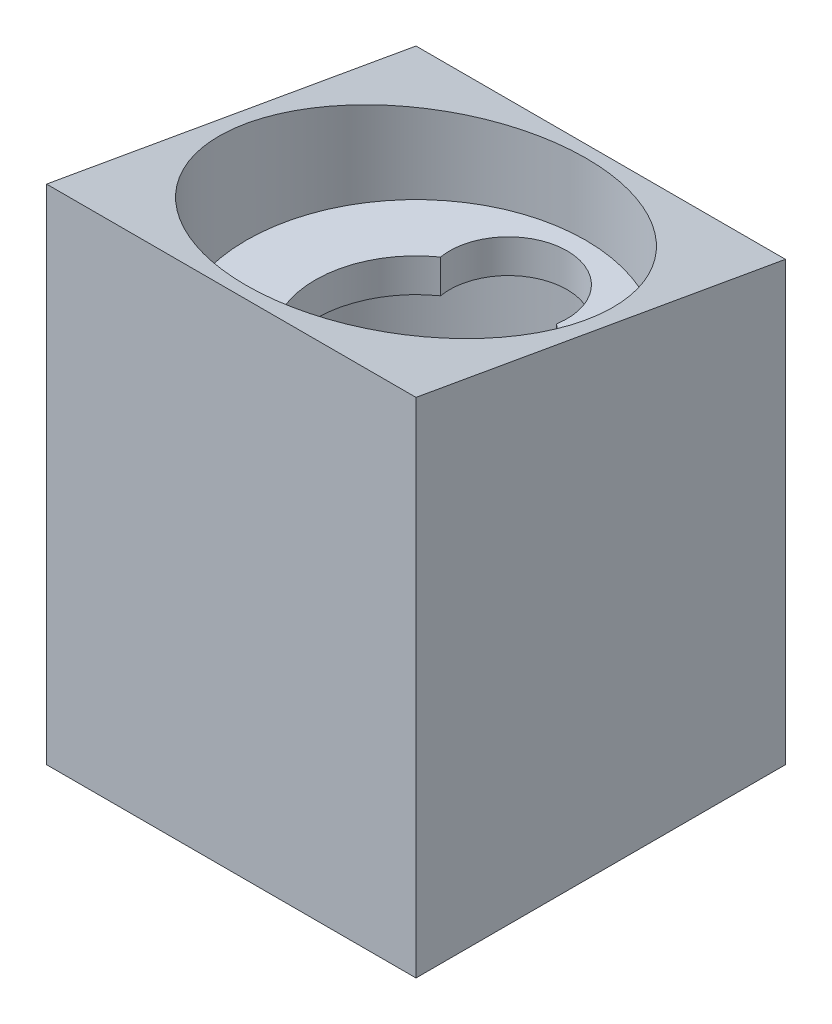
ISO-10303-21;
HEADER;
FILE_DESCRIPTION(('STEP AP214'),'2;1');
FILE_NAME('part.step','',(''),(''),'','','');
FILE_SCHEMA(('AUTOMOTIVE_DESIGN { 1 0 10303 214 1 1 1 1 }'));
ENDSEC;
DATA;
#1=APPLICATION_CONTEXT('core data for automotive mechanical design processes');
#2=APPLICATION_PROTOCOL_DEFINITION('international standard','automotive_design',2000,#1);
#3=PRODUCT_CONTEXT('',#1,'mechanical');
#4=PRODUCT('Part','Part','',(#3));
#5=PRODUCT_RELATED_PRODUCT_CATEGORY('part','',(#4));
#6=PRODUCT_DEFINITION_FORMATION('','',#4);
#7=PRODUCT_DEFINITION_CONTEXT('part definition',#1,'design');
#8=PRODUCT_DEFINITION('design','',#6,#7);
#9=PRODUCT_DEFINITION_SHAPE('','',#8);
#10=(LENGTH_UNIT() NAMED_UNIT(*) SI_UNIT(.MILLI.,.METRE.));
#11=(NAMED_UNIT(*) PLANE_ANGLE_UNIT() SI_UNIT($,.RADIAN.));
#12=(NAMED_UNIT(*) SI_UNIT($,.STERADIAN.) SOLID_ANGLE_UNIT());
#13=UNCERTAINTY_MEASURE_WITH_UNIT(LENGTH_MEASURE(1.E-05),#10,'distance_accuracy_value','');
#14=(GEOMETRIC_REPRESENTATION_CONTEXT(3) GLOBAL_UNCERTAINTY_ASSIGNED_CONTEXT((#13)) GLOBAL_UNIT_ASSIGNED_CONTEXT((#10,
#11,#12)) REPRESENTATION_CONTEXT('',''));
#15=CARTESIAN_POINT('',(0.,0.,0.));
#16=DIRECTION('',(0.,0.,1.));
#17=DIRECTION('',(1.,0.,0.));
#18=AXIS2_PLACEMENT_3D('',#15,#16,#17);
#19=CARTESIAN_POINT('',(11.,-20.,-11.));
#20=DIRECTION('',(1.,0.,0.));
#21=DIRECTION('',(0.,0.,-1.));
#22=AXIS2_PLACEMENT_3D('',#19,#20,#21);
#23=PLANE('',#22);
#24=DIRECTION('',(0.,1.,0.));
#25=VECTOR('',#24,1.);
#26=CARTESIAN_POINT('',(11.,-20.,-11.));
#27=LINE('',#26,#25);
#28=CARTESIAN_POINT('',(11.,-20.,-11.));
#29=VERTEX_POINT('',#28);
#30=CARTESIAN_POINT('',(11.,6.06291723,-11.));
#31=VERTEX_POINT('',#30);
#32=EDGE_CURVE('E111',#29,#31,#27,.T.);
#33=ORIENTED_EDGE('',*,*,#32,.T.);
#34=DIRECTION('',(0.,0.173648177666931,0.984807753012208));
#35=VECTOR('',#34,1.);
#36=CARTESIAN_POINT('',(11.,6.06291723,-11.));
#37=LINE('',#36,#35);
#38=CARTESIAN_POINT('',(11.,9.94211080558623,11.));
#39=VERTEX_POINT('',#38);
#40=EDGE_CURVE('E67',#31,#39,#37,.T.);
#41=ORIENTED_EDGE('',*,*,#40,.T.);
#42=DIRECTION('',(0.,1.,0.));
#43=VECTOR('',#42,1.);
#44=CARTESIAN_POINT('',(11.,-20.,11.));
#45=LINE('',#44,#43);
#46=CARTESIAN_POINT('',(11.,-20.,11.));
#47=VERTEX_POINT('',#46);
#48=EDGE_CURVE('E12',#47,#39,#45,.T.);
#49=ORIENTED_EDGE('',*,*,#48,.F.);
#50=DIRECTION('',(0.,0.,-1.));
#51=VECTOR('',#50,1.);
#52=CARTESIAN_POINT('',(11.,-20.,-11.));
#53=LINE('',#52,#51);
#54=EDGE_CURVE('E121',#47,#29,#53,.T.);
#55=ORIENTED_EDGE('',*,*,#54,.T.);
#56=EDGE_LOOP('',(#33,#41,#49,#55));
#57=FACE_BOUND('',#56,.T.);
#58=ADVANCED_FACE('F51',(#57),#23,.T.);
#59=CARTESIAN_POINT('',(-11.,-20.,11.));
#60=DIRECTION('',(0.,0.,1.));
#61=DIRECTION('',(1.,0.,0.));
#62=AXIS2_PLACEMENT_3D('',#59,#60,#61);
#63=PLANE('',#62);
#64=ORIENTED_EDGE('',*,*,#48,.T.);
#65=DIRECTION('',(1.,0.,0.));
#66=VECTOR('',#65,1.);
#67=CARTESIAN_POINT('',(-11.,9.94211080558623,11.));
#68=LINE('',#67,#66);
#69=CARTESIAN_POINT('',(-11.,9.94211080558623,11.));
#70=VERTEX_POINT('',#69);
#71=EDGE_CURVE('E94',#70,#39,#68,.T.);
#72=ORIENTED_EDGE('',*,*,#71,.F.);
#73=DIRECTION('',(0.,1.,0.));
#74=VECTOR('',#73,1.);
#75=CARTESIAN_POINT('',(-11.,-20.,11.));
#76=LINE('',#75,#74);
#77=CARTESIAN_POINT('',(-11.,-20.,11.));
#78=VERTEX_POINT('',#77);
#79=EDGE_CURVE('E59',#78,#70,#76,.T.);
#80=ORIENTED_EDGE('',*,*,#79,.F.);
#81=DIRECTION('',(1.,0.,0.));
#82=VECTOR('',#81,1.);
#83=CARTESIAN_POINT('',(-11.,-20.,11.));
#84=LINE('',#83,#82);
#85=EDGE_CURVE('E115',#78,#47,#84,.T.);
#86=ORIENTED_EDGE('',*,*,#85,.T.);
#87=EDGE_LOOP('',(#64,#72,#80,#86));
#88=FACE_BOUND('',#87,.T.);
#89=ADVANCED_FACE('F101',(#88),#63,.T.);
#90=CARTESIAN_POINT('',(-11.,-20.,-11.));
#91=DIRECTION('',(-1.,0.,0.));
#92=DIRECTION('',(0.,0.,1.));
#93=AXIS2_PLACEMENT_3D('',#90,#91,#92);
#94=PLANE('',#93);
#95=ORIENTED_EDGE('',*,*,#79,.T.);
#96=DIRECTION('',(0.,0.173648177666931,0.984807753012208));
#97=VECTOR('',#96,1.);
#98=CARTESIAN_POINT('',(-11.,6.06291723,-11.));
#99=LINE('',#98,#97);
#100=CARTESIAN_POINT('',(-11.,6.06291723,-11.));
#101=VERTEX_POINT('',#100);
#102=EDGE_CURVE('E90',#101,#70,#99,.T.);
#103=ORIENTED_EDGE('',*,*,#102,.F.);
#104=DIRECTION('',(0.,1.,0.));
#105=VECTOR('',#104,1.);
#106=CARTESIAN_POINT('',(-11.,-20.,-11.));
#107=LINE('',#106,#105);
#108=CARTESIAN_POINT('',(-11.,-20.,-11.));
#109=VERTEX_POINT('',#108);
#110=EDGE_CURVE('E109',#109,#101,#107,.T.);
#111=ORIENTED_EDGE('',*,*,#110,.F.);
#112=DIRECTION('',(0.,0.,1.));
#113=VECTOR('',#112,1.);
#114=CARTESIAN_POINT('',(-11.,-20.,-11.));
#115=LINE('',#114,#113);
#116=EDGE_CURVE('E107',#109,#78,#115,.T.);
#117=ORIENTED_EDGE('',*,*,#116,.T.);
#118=EDGE_LOOP('',(#95,#103,#111,#117));
#119=FACE_BOUND('',#118,.T.);
#120=ADVANCED_FACE('F105',(#119),#94,.T.);
#121=CARTESIAN_POINT('',(-11.,-20.,-11.));
#122=DIRECTION('',(0.,0.,-1.));
#123=DIRECTION('',(-1.,0.,0.));
#124=AXIS2_PLACEMENT_3D('',#121,#122,#123);
#125=PLANE('',#124);
#126=ORIENTED_EDGE('',*,*,#110,.T.);
#127=DIRECTION('',(1.,0.,0.));
#128=VECTOR('',#127,1.);
#129=CARTESIAN_POINT('',(-11.,6.06291723,-11.));
#130=LINE('',#129,#128);
#131=EDGE_CURVE('E95',#101,#31,#130,.T.);
#132=ORIENTED_EDGE('',*,*,#131,.T.);
#133=ORIENTED_EDGE('',*,*,#32,.F.);
#134=DIRECTION('',(-1.,0.,0.));
#135=VECTOR('',#134,1.);
#136=CARTESIAN_POINT('',(-11.,-20.,-11.));
#137=LINE('',#136,#135);
#138=EDGE_CURVE('E116',#29,#109,#137,.T.);
#139=ORIENTED_EDGE('',*,*,#138,.T.);
#140=EDGE_LOOP('',(#126,#132,#133,#139));
#141=FACE_BOUND('',#140,.T.);
#142=ADVANCED_FACE('F159',(#141),#125,.T.);
#143=CARTESIAN_POINT('',(0.,-20.,0.));
#144=DIRECTION('',(0.,1.,0.));
#145=DIRECTION('',(0.,0.,1.));
#146=AXIS2_PLACEMENT_3D('',#143,#144,#145);
#147=CYLINDRICAL_SURFACE('',#146,10.125);
#148=CARTESIAN_POINT('',(0.,-20.,0.));
#149=DIRECTION('',(0.,1.,0.));
#150=DIRECTION('',(0.,0.,1.));
#151=AXIS2_PLACEMENT_3D('',#148,#149,#150);
#152=CIRCLE('',#151,10.125);
#153=CARTESIAN_POINT('',(0.,-20.,10.125));
#154=VERTEX_POINT('',#153);
#155=EDGE_CURVE('E123',#154,#154,#152,.T.);
#156=ORIENTED_EDGE('',*,*,#155,.F.);
#157=EDGE_LOOP('',(#156));
#158=FACE_BOUND('',#157,.T.);
#159=CARTESIAN_POINT('',(0.,8.00251401779312,0.));
#160=DIRECTION('',(0.,0.984807753012208,-0.173648177666931));
#161=DIRECTION('',(0.,0.173648177666931,0.984807753012208));
#162=AXIS2_PLACEMENT_3D('',#159,#160,#161);
#163=ELLIPSE('',#162,10.2811944453432,10.125);
#164=CARTESIAN_POINT('',(0.,9.78782469746633,10.125));
#165=VERTEX_POINT('',#164);
#166=EDGE_CURVE('E54',#165,#165,#163,.F.);
#167=ORIENTED_EDGE('',*,*,#166,.F.);
#168=EDGE_LOOP('',(#167));
#169=FACE_BOUND('',#168,.T.);
#170=ADVANCED_FACE('F165',(#158,#169),#147,.F.);
#171=CARTESIAN_POINT('',(0.,-20.,0.));
#172=DIRECTION('',(0.,1.,0.));
#173=DIRECTION('',(0.,0.,1.));
#174=AXIS2_PLACEMENT_3D('',#171,#172,#173);
#175=PLANE('',#174);
#176=CARTESIAN_POINT('',(9.25,-20.,9.));
#177=DIRECTION('',(0.,-1.,0.));
#178=DIRECTION('',(0.,0.,1.));
#179=AXIS2_PLACEMENT_3D('',#176,#177,#178);
#180=CIRCLE('',#179,0.985);
#181=CARTESIAN_POINT('',(9.25,-20.,9.985));
#182=VERTEX_POINT('',#181);
#183=EDGE_CURVE('E136',#182,#182,#180,.T.);
#184=ORIENTED_EDGE('',*,*,#183,.F.);
#185=EDGE_LOOP('',(#184));
#186=FACE_BOUND('',#185,.T.);
#187=CARTESIAN_POINT('',(9.24999999999999,-20.,-9.));
#188=DIRECTION('',(0.,-1.,0.));
#189=DIRECTION('',(0.,0.,-1.));
#190=AXIS2_PLACEMENT_3D('',#187,#188,#189);
#191=CIRCLE('',#190,0.985);
#192=CARTESIAN_POINT('',(9.24999999999999,-20.,-9.985));
#193=VERTEX_POINT('',#192);
#194=EDGE_CURVE('E142',#193,#193,#191,.T.);
#195=ORIENTED_EDGE('',*,*,#194,.F.);
#196=EDGE_LOOP('',(#195));
#197=FACE_BOUND('',#196,.T.);
#198=CARTESIAN_POINT('',(-9.25,-20.,-9.));
#199=DIRECTION('',(0.,-1.,0.));
#200=DIRECTION('',(0.,0.,1.));
#201=AXIS2_PLACEMENT_3D('',#198,#199,#200);
#202=CIRCLE('',#201,0.985);
#203=CARTESIAN_POINT('',(-9.25,-20.,-8.015));
#204=VERTEX_POINT('',#203);
#205=EDGE_CURVE('E130',#204,#204,#202,.T.);
#206=ORIENTED_EDGE('',*,*,#205,.F.);
#207=EDGE_LOOP('',(#206));
#208=FACE_BOUND('',#207,.T.);
#209=CARTESIAN_POINT('',(-9.25,-20.,9.));
#210=DIRECTION('',(0.,-1.,0.));
#211=DIRECTION('',(0.,0.,-1.));
#212=AXIS2_PLACEMENT_3D('',#209,#210,#211);
#213=CIRCLE('',#212,0.985);
#214=CARTESIAN_POINT('',(-9.25,-20.,8.015));
#215=VERTEX_POINT('',#214);
#216=EDGE_CURVE('E127',#215,#215,#213,.T.);
#217=ORIENTED_EDGE('',*,*,#216,.F.);
#218=EDGE_LOOP('',(#217));
#219=FACE_BOUND('',#218,.T.);
#220=ORIENTED_EDGE('',*,*,#155,.T.);
#221=EDGE_LOOP('',(#220));
#222=FACE_BOUND('',#221,.T.);
#223=ORIENTED_EDGE('',*,*,#54,.F.);
#224=ORIENTED_EDGE('',*,*,#85,.F.);
#225=ORIENTED_EDGE('',*,*,#116,.F.);
#226=ORIENTED_EDGE('',*,*,#138,.F.);
#227=EDGE_LOOP('',(#223,#224,#225,#226));
#228=FACE_BOUND('',#227,.T.);
#229=ADVANCED_FACE('F162',(#186,#197,#208,#219,#222,#228),#175,.F.);
#230=CARTESIAN_POINT('',(-9.25,-14.,9.));
#231=DIRECTION('',(0.,-1.,0.));
#232=DIRECTION('',(0.,0.,-1.));
#233=AXIS2_PLACEMENT_3D('',#230,#231,#232);
#234=CYLINDRICAL_SURFACE('',#233,0.985);
#235=CARTESIAN_POINT('',(-9.25,-14.,9.));
#236=DIRECTION('',(0.,-1.,0.));
#237=DIRECTION('',(0.,0.,-1.));
#238=AXIS2_PLACEMENT_3D('',#235,#236,#237);
#239=CIRCLE('',#238,0.985);
#240=CARTESIAN_POINT('',(-9.25,-14.,8.015));
#241=VERTEX_POINT('',#240);
#242=EDGE_CURVE('E126',#241,#241,#239,.T.);
#243=ORIENTED_EDGE('',*,*,#242,.F.);
#244=EDGE_LOOP('',(#243));
#245=FACE_BOUND('',#244,.T.);
#246=ORIENTED_EDGE('',*,*,#216,.T.);
#247=EDGE_LOOP('',(#246));
#248=FACE_BOUND('',#247,.T.);
#249=ADVANCED_FACE('F174',(#245,#248),#234,.F.);
#250=CARTESIAN_POINT('',(-9.25,-14.,9.));
#251=DIRECTION('',(0.,-1.,0.));
#252=DIRECTION('',(0.,0.,-1.));
#253=AXIS2_PLACEMENT_3D('',#250,#251,#252);
#254=PLANE('',#253);
#255=ORIENTED_EDGE('',*,*,#242,.T.);
#256=EDGE_LOOP('',(#255));
#257=FACE_BOUND('',#256,.T.);
#258=ADVANCED_FACE('F179',(#257),#254,.T.);
#259=CARTESIAN_POINT('',(-9.25,-14.,-9.));
#260=DIRECTION('',(0.,-1.,0.));
#261=DIRECTION('',(0.,0.,-1.));
#262=AXIS2_PLACEMENT_3D('',#259,#260,#261);
#263=CYLINDRICAL_SURFACE('',#262,0.985);
#264=CARTESIAN_POINT('',(-9.25,-14.,-9.));
#265=DIRECTION('',(0.,-1.,0.));
#266=DIRECTION('',(0.,0.,1.));
#267=AXIS2_PLACEMENT_3D('',#264,#265,#266);
#268=CIRCLE('',#267,0.985);
#269=CARTESIAN_POINT('',(-9.25,-14.,-8.015));
#270=VERTEX_POINT('',#269);
#271=EDGE_CURVE('E145',#270,#270,#268,.T.);
#272=ORIENTED_EDGE('',*,*,#271,.F.);
#273=EDGE_LOOP('',(#272));
#274=FACE_BOUND('',#273,.T.);
#275=ORIENTED_EDGE('',*,*,#205,.T.);
#276=EDGE_LOOP('',(#275));
#277=FACE_BOUND('',#276,.T.);
#278=ADVANCED_FACE('F204',(#274,#277),#263,.F.);
#279=CARTESIAN_POINT('',(-9.25,-14.,-9.));
#280=DIRECTION('',(0.,1.,0.));
#281=DIRECTION('',(0.,0.,1.));
#282=AXIS2_PLACEMENT_3D('',#279,#280,#281);
#283=PLANE('',#282);
#284=ORIENTED_EDGE('',*,*,#271,.T.);
#285=EDGE_LOOP('',(#284));
#286=FACE_BOUND('',#285,.T.);
#287=ADVANCED_FACE('F207',(#286),#283,.F.);
#288=CARTESIAN_POINT('',(9.24999999999999,-14.,-9.));
#289=DIRECTION('',(0.,-1.,0.));
#290=DIRECTION('',(0.,0.,-1.));
#291=AXIS2_PLACEMENT_3D('',#288,#289,#290);
#292=CYLINDRICAL_SURFACE('',#291,0.985);
#293=CARTESIAN_POINT('',(9.24999999999999,-14.,-9.));
#294=DIRECTION('',(0.,-1.,0.));
#295=DIRECTION('',(0.,0.,-1.));
#296=AXIS2_PLACEMENT_3D('',#293,#294,#295);
#297=CIRCLE('',#296,0.985);
#298=CARTESIAN_POINT('',(9.24999999999999,-14.,-9.985));
#299=VERTEX_POINT('',#298);
#300=EDGE_CURVE('E139',#299,#299,#297,.T.);
#301=ORIENTED_EDGE('',*,*,#300,.F.);
#302=EDGE_LOOP('',(#301));
#303=FACE_BOUND('',#302,.T.);
#304=ORIENTED_EDGE('',*,*,#194,.T.);
#305=EDGE_LOOP('',(#304));
#306=FACE_BOUND('',#305,.T.);
#307=ADVANCED_FACE('F211',(#303,#306),#292,.F.);
#308=CARTESIAN_POINT('',(9.24999999999999,-14.,-9.));
#309=DIRECTION('',(0.,-1.,0.));
#310=DIRECTION('',(0.,0.,-1.));
#311=AXIS2_PLACEMENT_3D('',#308,#309,#310);
#312=PLANE('',#311);
#313=ORIENTED_EDGE('',*,*,#300,.T.);
#314=EDGE_LOOP('',(#313));
#315=FACE_BOUND('',#314,.T.);
#316=ADVANCED_FACE('F215',(#315),#312,.T.);
#317=CARTESIAN_POINT('',(9.25,-14.,9.));
#318=DIRECTION('',(0.,-1.,0.));
#319=DIRECTION('',(0.,0.,-1.));
#320=AXIS2_PLACEMENT_3D('',#317,#318,#319);
#321=CYLINDRICAL_SURFACE('',#320,0.985);
#322=CARTESIAN_POINT('',(9.25,-14.,9.));
#323=DIRECTION('',(0.,-1.,0.));
#324=DIRECTION('',(0.,0.,1.));
#325=AXIS2_PLACEMENT_3D('',#322,#323,#324);
#326=CIRCLE('',#325,0.985);
#327=CARTESIAN_POINT('',(9.25,-14.,9.985));
#328=VERTEX_POINT('',#327);
#329=EDGE_CURVE('E133',#328,#328,#326,.T.);
#330=ORIENTED_EDGE('',*,*,#329,.F.);
#331=EDGE_LOOP('',(#330));
#332=FACE_BOUND('',#331,.T.);
#333=ORIENTED_EDGE('',*,*,#183,.T.);
#334=EDGE_LOOP('',(#333));
#335=FACE_BOUND('',#334,.T.);
#336=ADVANCED_FACE('F200',(#332,#335),#321,.F.);
#337=CARTESIAN_POINT('',(9.25,-14.,9.));
#338=DIRECTION('',(0.,1.,0.));
#339=DIRECTION('',(0.,0.,1.));
#340=AXIS2_PLACEMENT_3D('',#337,#338,#339);
#341=PLANE('',#340);
#342=ORIENTED_EDGE('',*,*,#329,.T.);
#343=EDGE_LOOP('',(#342));
#344=FACE_BOUND('',#343,.T.);
#345=ADVANCED_FACE('F195',(#344),#341,.F.);
#346=CARTESIAN_POINT('',(-11.,6.06291723,-11.));
#347=DIRECTION('',(0.,0.984807753012208,-0.173648177666931));
#348=DIRECTION('',(0.,0.173648177666931,0.984807753012208));
#349=AXIS2_PLACEMENT_3D('',#346,#347,#348);
#350=PLANE('',#349);
#351=ORIENTED_EDGE('',*,*,#40,.F.);
#352=ORIENTED_EDGE('',*,*,#131,.F.);
#353=ORIENTED_EDGE('',*,*,#102,.T.);
#354=ORIENTED_EDGE('',*,*,#71,.T.);
#355=EDGE_LOOP('',(#351,#352,#353,#354));
#356=FACE_BOUND('',#355,.T.);
#357=ORIENTED_EDGE('',*,*,#166,.T.);
#358=EDGE_LOOP('',(#357));
#359=FACE_BOUND('',#358,.T.);
#360=ADVANCED_FACE('F92',(#356,#359),#350,.T.);
#361=CLOSED_SHELL('',(#58,#89,#120,#142,#170,#229,#249,#258,#278,#287,#307,#316,#336,#345,#360));
#362=MANIFOLD_SOLID_BREP('B2',#361);
#363=CARTESIAN_POINT('',(0.,2.,0.));
#364=DIRECTION('',(0.,1.,0.));
#365=DIRECTION('',(0.,0.,1.));
#366=AXIS2_PLACEMENT_3D('',#363,#364,#365);
#367=PLANE('',#366);
#368=CARTESIAN_POINT('',(0.,2.,0.));
#369=DIRECTION('',(0.,1.,0.));
#370=DIRECTION('',(0.,0.,1.));
#371=AXIS2_PLACEMENT_3D('',#368,#369,#370);
#372=CIRCLE('',#371,10.1);
#373=CARTESIAN_POINT('',(0.,2.,10.1));
#374=VERTEX_POINT('',#373);
#375=EDGE_CURVE('E49',#374,#374,#372,.T.);
#376=ORIENTED_EDGE('',*,*,#375,.T.);
#377=EDGE_LOOP('',(#376));
#378=FACE_BOUND('',#377,.T.);
#379=CARTESIAN_POINT('',(0.,2.,-5.5));
#380=DIRECTION('',(0.,1.,0.));
#381=DIRECTION('',(0.,0.,-1.));
#382=AXIS2_PLACEMENT_3D('',#379,#380,#381);
#383=CIRCLE('',#382,3.5);
#384=CARTESIAN_POINT('',(3.44975744745641,2.,-4.90909090909091));
#385=VERTEX_POINT('',#384);
#386=CARTESIAN_POINT('',(-3.44975744745641,2.,-4.90909090909091));
#387=VERTEX_POINT('',#386);
#388=EDGE_CURVE('E387',#385,#387,#383,.T.);
#389=ORIENTED_EDGE('',*,*,#388,.F.);
#390=CARTESIAN_POINT('',(0.,2.,0.));
#391=DIRECTION('',(0.,1.,0.));
#392=DIRECTION('',(0.,0.,1.));
#393=AXIS2_PLACEMENT_3D('',#390,#391,#392);
#394=CIRCLE('',#393,6.);
#395=EDGE_CURVE('E378',#387,#385,#394,.T.);
#396=ORIENTED_EDGE('',*,*,#395,.F.);
#397=EDGE_LOOP('',(#389,#396));
#398=FACE_BOUND('',#397,.T.);
#399=ADVANCED_FACE('F346',(#378,#398),#367,.T.);
#400=CARTESIAN_POINT('',(0.,0.,0.));
#401=DIRECTION('',(0.,1.,0.));
#402=DIRECTION('',(0.,0.,1.));
#403=AXIS2_PLACEMENT_3D('',#400,#401,#402);
#404=PLANE('',#403);
#405=CARTESIAN_POINT('',(0.,0.,0.));
#406=DIRECTION('',(0.,1.,0.));
#407=DIRECTION('',(0.,0.,1.));
#408=AXIS2_PLACEMENT_3D('',#405,#406,#407);
#409=CIRCLE('',#408,10.1);
#410=CARTESIAN_POINT('',(0.,0.,10.1));
#411=VERTEX_POINT('',#410);
#412=EDGE_CURVE('E350',#411,#411,#409,.T.);
#413=ORIENTED_EDGE('',*,*,#412,.F.);
#414=EDGE_LOOP('',(#413));
#415=FACE_BOUND('',#414,.T.);
#416=CARTESIAN_POINT('',(0.,0.,0.));
#417=DIRECTION('',(0.,1.,0.));
#418=DIRECTION('',(0.,0.,1.));
#419=AXIS2_PLACEMENT_3D('',#416,#417,#418);
#420=CIRCLE('',#419,6.);
#421=CARTESIAN_POINT('',(-3.44975744745641,0.,-4.90909090909091));
#422=VERTEX_POINT('',#421);
#423=CARTESIAN_POINT('',(3.44975744745641,0.,-4.90909090909091));
#424=VERTEX_POINT('',#423);
#425=EDGE_CURVE('E368',#422,#424,#420,.T.);
#426=ORIENTED_EDGE('',*,*,#425,.T.);
#427=CARTESIAN_POINT('',(0.,0.,-5.5));
#428=DIRECTION('',(0.,1.,0.));
#429=DIRECTION('',(0.,0.,-1.));
#430=AXIS2_PLACEMENT_3D('',#427,#428,#429);
#431=CIRCLE('',#430,3.5);
#432=EDGE_CURVE('E374',#424,#422,#431,.T.);
#433=ORIENTED_EDGE('',*,*,#432,.T.);
#434=EDGE_LOOP('',(#426,#433));
#435=FACE_BOUND('',#434,.T.);
#436=ADVANCED_FACE('F384',(#415,#435),#404,.F.);
#437=CARTESIAN_POINT('',(0.,2.,0.));
#438=DIRECTION('',(0.,-1.,0.));
#439=DIRECTION('',(0.,0.,-1.));
#440=AXIS2_PLACEMENT_3D('',#437,#438,#439);
#441=CYLINDRICAL_SURFACE('',#440,10.1);
#442=ORIENTED_EDGE('',*,*,#375,.F.);
#443=EDGE_LOOP('',(#442));
#444=FACE_BOUND('',#443,.T.);
#445=ORIENTED_EDGE('',*,*,#412,.T.);
#446=EDGE_LOOP('',(#445));
#447=FACE_BOUND('',#446,.T.);
#448=ADVANCED_FACE('F348',(#444,#447),#441,.T.);
#449=CARTESIAN_POINT('',(0.,2.,0.));
#450=DIRECTION('',(0.,-1.,0.));
#451=DIRECTION('',(0.,0.,-1.));
#452=AXIS2_PLACEMENT_3D('',#449,#450,#451);
#453=CYLINDRICAL_SURFACE('',#452,6.);
#454=ORIENTED_EDGE('',*,*,#425,.F.);
#455=DIRECTION('',(0.,-1.,0.));
#456=VECTOR('',#455,1.);
#457=CARTESIAN_POINT('',(-3.44975744745641,2.,-4.90909090909091));
#458=LINE('',#457,#456);
#459=EDGE_CURVE('E376',#387,#422,#458,.T.);
#460=ORIENTED_EDGE('',*,*,#459,.F.);
#461=ORIENTED_EDGE('',*,*,#395,.T.);
#462=DIRECTION('',(0.,-1.,0.));
#463=VECTOR('',#462,1.);
#464=CARTESIAN_POINT('',(3.44975744745641,2.,-4.90909090909091));
#465=LINE('',#464,#463);
#466=EDGE_CURVE('E361',#385,#424,#465,.T.);
#467=ORIENTED_EDGE('',*,*,#466,.T.);
#468=EDGE_LOOP('',(#454,#460,#461,#467));
#469=FACE_BOUND('',#468,.T.);
#470=ADVANCED_FACE('F380',(#469),#453,.F.);
#471=CARTESIAN_POINT('',(0.,2.,-5.5));
#472=DIRECTION('',(0.,-1.,0.));
#473=DIRECTION('',(0.,0.,-1.));
#474=AXIS2_PLACEMENT_3D('',#471,#472,#473);
#475=CYLINDRICAL_SURFACE('',#474,3.5);
#476=ORIENTED_EDGE('',*,*,#432,.F.);
#477=ORIENTED_EDGE('',*,*,#466,.F.);
#478=ORIENTED_EDGE('',*,*,#388,.T.);
#479=ORIENTED_EDGE('',*,*,#459,.T.);
#480=EDGE_LOOP('',(#476,#477,#478,#479));
#481=FACE_BOUND('',#480,.T.);
#482=ADVANCED_FACE('F375',(#481),#475,.F.);
#483=CLOSED_SHELL('',(#399,#436,#448,#470,#482));
#484=MANIFOLD_SOLID_BREP('B6',#483);
#485=ADVANCED_BREP_SHAPE_REPRESENTATION('',(#18,#362,#484),#14);
#486=SHAPE_DEFINITION_REPRESENTATION(#9,#485);
ENDSEC;
END-ISO-10303-21;
